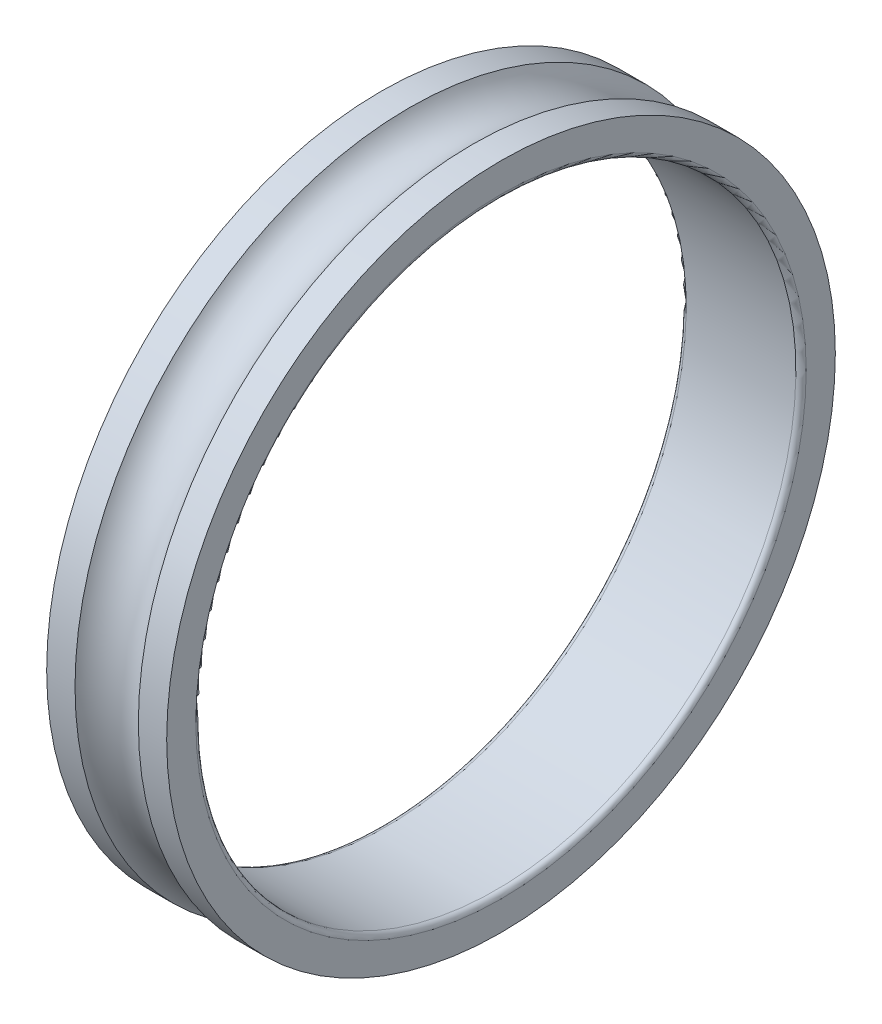
ISO-10303-21;
HEADER;
FILE_DESCRIPTION(('STEP AP214'),'2;1');
FILE_NAME('part.step','',(''),(''),'','','');
FILE_SCHEMA(('AUTOMOTIVE_DESIGN { 1 0 10303 214 1 1 1 1 }'));
ENDSEC;
DATA;
#1=APPLICATION_CONTEXT('core data for automotive mechanical design processes');
#2=APPLICATION_PROTOCOL_DEFINITION('international standard','automotive_design',2000,#1);
#3=PRODUCT_CONTEXT('',#1,'mechanical');
#4=PRODUCT('Part','Part','',(#3));
#5=PRODUCT_RELATED_PRODUCT_CATEGORY('part','',(#4));
#6=PRODUCT_DEFINITION_FORMATION('','',#4);
#7=PRODUCT_DEFINITION_CONTEXT('part definition',#1,'design');
#8=PRODUCT_DEFINITION('design','',#6,#7);
#9=PRODUCT_DEFINITION_SHAPE('','',#8);
#10=(LENGTH_UNIT() NAMED_UNIT(*) SI_UNIT(.MILLI.,.METRE.));
#11=(NAMED_UNIT(*) PLANE_ANGLE_UNIT() SI_UNIT($,.RADIAN.));
#12=(NAMED_UNIT(*) SI_UNIT($,.STERADIAN.) SOLID_ANGLE_UNIT());
#13=UNCERTAINTY_MEASURE_WITH_UNIT(LENGTH_MEASURE(1.E-05),#10,'distance_accuracy_value','');
#14=(GEOMETRIC_REPRESENTATION_CONTEXT(3) GLOBAL_UNCERTAINTY_ASSIGNED_CONTEXT((#13)) GLOBAL_UNIT_ASSIGNED_CONTEXT((#10,
#11,#12)) REPRESENTATION_CONTEXT('',''));
#15=CARTESIAN_POINT('',(0.,0.,0.));
#16=DIRECTION('',(0.,0.,1.));
#17=DIRECTION('',(1.,0.,0.));
#18=AXIS2_PLACEMENT_3D('',#15,#16,#17);
#19=CARTESIAN_POINT('',(-3.2,0.,0.));
#20=DIRECTION('',(1.,0.,0.));
#21=DIRECTION('',(0.,0.,-1.));
#22=AXIS2_PLACEMENT_3D('',#19,#20,#21);
#23=TOROIDAL_SURFACE('',#22,17.8,0.3);
#24=CARTESIAN_POINT('',(-3.2,0.,0.));
#25=DIRECTION('',(1.,0.,0.));
#26=DIRECTION('',(0.,1.,0.));
#27=AXIS2_PLACEMENT_3D('',#24,#25,#26);
#28=CIRCLE('',#27,17.5);
#29=CARTESIAN_POINT('',(-3.2,17.5,0.));
#30=VERTEX_POINT('',#29);
#31=EDGE_CURVE('E10',#30,#30,#28,.T.);
#32=ORIENTED_EDGE('',*,*,#31,.T.);
#33=EDGE_LOOP('',(#32));
#34=FACE_BOUND('',#33,.T.);
#35=CARTESIAN_POINT('',(-3.5,0.,0.));
#36=DIRECTION('',(1.,0.,0.));
#37=DIRECTION('',(0.,1.,0.));
#38=AXIS2_PLACEMENT_3D('',#35,#36,#37);
#39=CIRCLE('',#38,17.8);
#40=CARTESIAN_POINT('',(-3.5,17.8,0.));
#41=VERTEX_POINT('',#40);
#42=EDGE_CURVE('E57',#41,#41,#39,.T.);
#43=ORIENTED_EDGE('',*,*,#42,.F.);
#44=EDGE_LOOP('',(#43));
#45=FACE_BOUND('',#44,.T.);
#46=ADVANCED_FACE('F15',(#34,#45),#23,.T.);
#47=CARTESIAN_POINT('',(0.,0.,0.));
#48=DIRECTION('',(-1.,0.,0.));
#49=DIRECTION('',(0.,1.,0.));
#50=AXIS2_PLACEMENT_3D('',#47,#48,#49);
#51=CYLINDRICAL_SURFACE('',#50,17.5);
#52=CARTESIAN_POINT('',(3.2,0.,0.));
#53=DIRECTION('',(1.,0.,0.));
#54=DIRECTION('',(0.,1.,0.));
#55=AXIS2_PLACEMENT_3D('',#52,#53,#54);
#56=CIRCLE('',#55,17.5);
#57=CARTESIAN_POINT('',(3.2,17.5,0.));
#58=VERTEX_POINT('',#57);
#59=EDGE_CURVE('E19',#58,#58,#56,.T.);
#60=ORIENTED_EDGE('',*,*,#59,.T.);
#61=EDGE_LOOP('',(#60));
#62=FACE_BOUND('',#61,.T.);
#63=ORIENTED_EDGE('',*,*,#31,.F.);
#64=EDGE_LOOP('',(#63));
#65=FACE_BOUND('',#64,.T.);
#66=ADVANCED_FACE('F71',(#62,#65),#51,.F.);
#67=CARTESIAN_POINT('',(3.2,0.,0.));
#68=DIRECTION('',(1.,0.,0.));
#69=DIRECTION('',(0.,0.,-1.));
#70=AXIS2_PLACEMENT_3D('',#67,#68,#69);
#71=TOROIDAL_SURFACE('',#70,17.8,0.3);
#72=CARTESIAN_POINT('',(3.5,0.,0.));
#73=DIRECTION('',(1.,0.,0.));
#74=DIRECTION('',(0.,1.,0.));
#75=AXIS2_PLACEMENT_3D('',#72,#73,#74);
#76=CIRCLE('',#75,17.8);
#77=CARTESIAN_POINT('',(3.5,17.8,0.));
#78=VERTEX_POINT('',#77);
#79=EDGE_CURVE('E51',#78,#78,#76,.T.);
#80=ORIENTED_EDGE('',*,*,#79,.T.);
#81=EDGE_LOOP('',(#80));
#82=FACE_BOUND('',#81,.T.);
#83=ORIENTED_EDGE('',*,*,#59,.F.);
#84=EDGE_LOOP('',(#83));
#85=FACE_BOUND('',#84,.T.);
#86=ADVANCED_FACE('F76',(#82,#85),#71,.T.);
#87=CARTESIAN_POINT('',(3.5,18.65,0.));
#88=DIRECTION('',(1.,0.,0.));
#89=DIRECTION('',(0.,1.,0.));
#90=AXIS2_PLACEMENT_3D('',#87,#88,#89);
#91=PLANE('',#90);
#92=CARTESIAN_POINT('',(3.5,0.,0.));
#93=DIRECTION('',(1.,0.,0.));
#94=DIRECTION('',(0.,1.,0.));
#95=AXIS2_PLACEMENT_3D('',#92,#93,#94);
#96=CIRCLE('',#95,19.5);
#97=CARTESIAN_POINT('',(3.5,19.5,0.));
#98=VERTEX_POINT('',#97);
#99=EDGE_CURVE('E47',#98,#98,#96,.T.);
#100=ORIENTED_EDGE('',*,*,#99,.T.);
#101=EDGE_LOOP('',(#100));
#102=FACE_BOUND('',#101,.T.);
#103=ORIENTED_EDGE('',*,*,#79,.F.);
#104=EDGE_LOOP('',(#103));
#105=FACE_BOUND('',#104,.T.);
#106=ADVANCED_FACE('F48',(#102,#105),#91,.T.);
#107=CARTESIAN_POINT('',(2.67330926563097,0.,0.));
#108=DIRECTION('',(-1.,0.,0.));
#109=DIRECTION('',(0.,1.,0.));
#110=AXIS2_PLACEMENT_3D('',#107,#108,#109);
#111=CYLINDRICAL_SURFACE('',#110,19.5);
#112=CARTESIAN_POINT('',(1.84661853126194,0.,0.));
#113=DIRECTION('',(1.,0.,0.));
#114=DIRECTION('',(0.,1.,0.));
#115=AXIS2_PLACEMENT_3D('',#112,#113,#114);
#116=CIRCLE('',#115,19.5);
#117=CARTESIAN_POINT('',(1.84661853126194,19.5,0.));
#118=VERTEX_POINT('',#117);
#119=EDGE_CURVE('E52',#118,#118,#116,.T.);
#120=ORIENTED_EDGE('',*,*,#119,.T.);
#121=EDGE_LOOP('',(#120));
#122=FACE_BOUND('',#121,.T.);
#123=ORIENTED_EDGE('',*,*,#99,.F.);
#124=EDGE_LOOP('',(#123));
#125=FACE_BOUND('',#124,.T.);
#126=ADVANCED_FACE('F17',(#122,#125),#111,.T.);
#127=CARTESIAN_POINT('',(0.,0.,0.));
#128=DIRECTION('',(1.,0.,0.));
#129=DIRECTION('',(0.,0.,-1.));
#130=AXIS2_PLACEMENT_3D('',#127,#128,#129);
#131=TOROIDAL_SURFACE('',#130,20.5,2.1);
#132=CARTESIAN_POINT('',(-1.84661853126194,0.,0.));
#133=DIRECTION('',(1.,0.,0.));
#134=DIRECTION('',(0.,1.,0.));
#135=AXIS2_PLACEMENT_3D('',#132,#133,#134);
#136=CIRCLE('',#135,19.5);
#137=CARTESIAN_POINT('',(-1.84661853126194,19.5,0.));
#138=VERTEX_POINT('',#137);
#139=EDGE_CURVE('E54',#138,#138,#136,.T.);
#140=ORIENTED_EDGE('',*,*,#139,.T.);
#141=EDGE_LOOP('',(#140));
#142=FACE_BOUND('',#141,.T.);
#143=ORIENTED_EDGE('',*,*,#119,.F.);
#144=EDGE_LOOP('',(#143));
#145=FACE_BOUND('',#144,.T.);
#146=ADVANCED_FACE('F82',(#142,#145),#131,.F.);
#147=CARTESIAN_POINT('',(-2.67330926563097,0.,0.));
#148=DIRECTION('',(-1.,0.,0.));
#149=DIRECTION('',(0.,1.,0.));
#150=AXIS2_PLACEMENT_3D('',#147,#148,#149);
#151=CYLINDRICAL_SURFACE('',#150,19.5);
#152=CARTESIAN_POINT('',(-3.5,0.,0.));
#153=DIRECTION('',(1.,0.,0.));
#154=DIRECTION('',(0.,1.,0.));
#155=AXIS2_PLACEMENT_3D('',#152,#153,#154);
#156=CIRCLE('',#155,19.5);
#157=CARTESIAN_POINT('',(-3.5,19.5,0.));
#158=VERTEX_POINT('',#157);
#159=EDGE_CURVE('E61',#158,#158,#156,.T.);
#160=ORIENTED_EDGE('',*,*,#159,.T.);
#161=EDGE_LOOP('',(#160));
#162=FACE_BOUND('',#161,.T.);
#163=ORIENTED_EDGE('',*,*,#139,.F.);
#164=EDGE_LOOP('',(#163));
#165=FACE_BOUND('',#164,.T.);
#166=ADVANCED_FACE('F84',(#162,#165),#151,.T.);
#167=CARTESIAN_POINT('',(-3.5,18.65,0.));
#168=DIRECTION('',(-1.,0.,0.));
#169=DIRECTION('',(0.,-1.,0.));
#170=AXIS2_PLACEMENT_3D('',#167,#168,#169);
#171=PLANE('',#170);
#172=ORIENTED_EDGE('',*,*,#42,.T.);
#173=EDGE_LOOP('',(#172));
#174=FACE_BOUND('',#173,.T.);
#175=ORIENTED_EDGE('',*,*,#159,.F.);
#176=EDGE_LOOP('',(#175));
#177=FACE_BOUND('',#176,.T.);
#178=ADVANCED_FACE('F67',(#174,#177),#171,.T.);
#179=CLOSED_SHELL('',(#46,#66,#86,#106,#126,#146,#166,#178));
#180=MANIFOLD_SOLID_BREP('B1',#179);
#181=ADVANCED_BREP_SHAPE_REPRESENTATION('',(#18,#180),#14);
#182=SHAPE_DEFINITION_REPRESENTATION(#9,#181);
ENDSEC;
END-ISO-10303-21;
